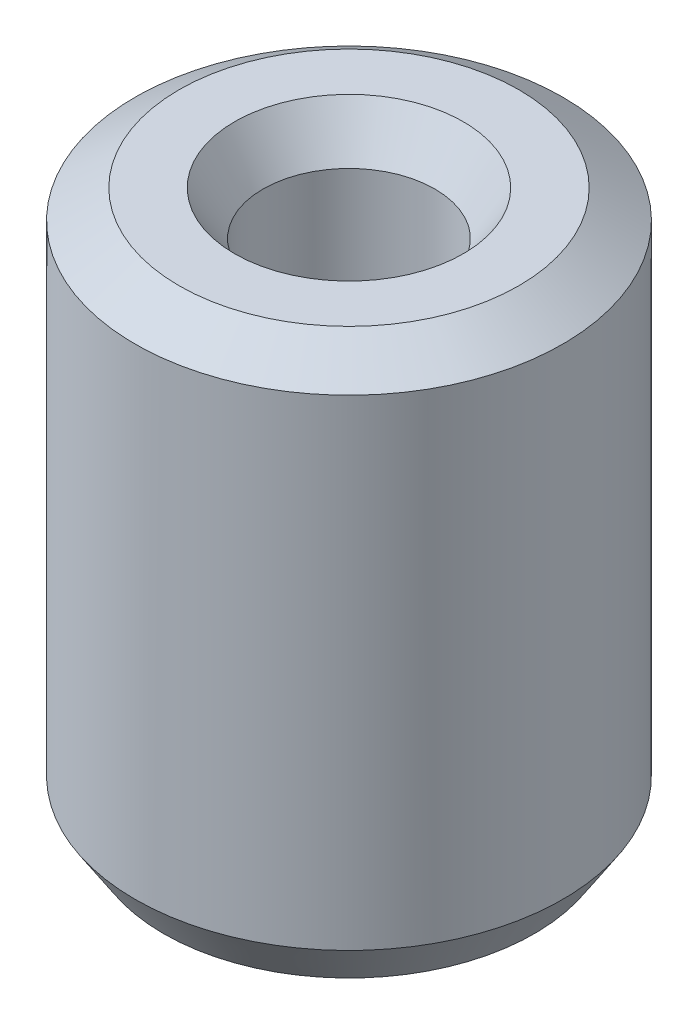
ISO-10303-21;
HEADER;
FILE_DESCRIPTION(('STEP AP214'),'2;1');
FILE_NAME('part.step','',(''),(''),'','','');
FILE_SCHEMA(('AUTOMOTIVE_DESIGN { 1 0 10303 214 1 1 1 1 }'));
ENDSEC;
DATA;
#1=APPLICATION_CONTEXT('core data for automotive mechanical design processes');
#2=APPLICATION_PROTOCOL_DEFINITION('international standard','automotive_design',2000,#1);
#3=PRODUCT_CONTEXT('',#1,'mechanical');
#4=PRODUCT('Part','Part','',(#3));
#5=PRODUCT_RELATED_PRODUCT_CATEGORY('part','',(#4));
#6=PRODUCT_DEFINITION_FORMATION('','',#4);
#7=PRODUCT_DEFINITION_CONTEXT('part definition',#1,'design');
#8=PRODUCT_DEFINITION('design','',#6,#7);
#9=PRODUCT_DEFINITION_SHAPE('','',#8);
#10=(LENGTH_UNIT() NAMED_UNIT(*) SI_UNIT(.MILLI.,.METRE.));
#11=(NAMED_UNIT(*) PLANE_ANGLE_UNIT() SI_UNIT($,.RADIAN.));
#12=(NAMED_UNIT(*) SI_UNIT($,.STERADIAN.) SOLID_ANGLE_UNIT());
#13=UNCERTAINTY_MEASURE_WITH_UNIT(LENGTH_MEASURE(1.E-05),#10,'distance_accuracy_value','');
#14=(GEOMETRIC_REPRESENTATION_CONTEXT(3) GLOBAL_UNCERTAINTY_ASSIGNED_CONTEXT((#13)) GLOBAL_UNIT_ASSIGNED_CONTEXT((#10,
#11,#12)) REPRESENTATION_CONTEXT('',''));
#15=CARTESIAN_POINT('',(0.,0.,0.));
#16=DIRECTION('',(0.,0.,1.));
#17=DIRECTION('',(1.,0.,0.));
#18=AXIS2_PLACEMENT_3D('',#15,#16,#17);
#19=CARTESIAN_POINT('',(0.,45.2807027686139,0.));
#20=DIRECTION('',(0.,-1.,0.));
#21=DIRECTION('',(0.,0.,-1.));
#22=AXIS2_PLACEMENT_3D('',#19,#20,#21);
#23=CYLINDRICAL_SURFACE('',#22,17.5);
#24=CARTESIAN_POINT('',(0.,3.60219334781976,0.));
#25=DIRECTION('',(0.,1.,0.));
#26=DIRECTION('',(0.,0.,1.));
#27=AXIS2_PLACEMENT_3D('',#24,#25,#26);
#28=CIRCLE('',#27,17.5);
#29=CARTESIAN_POINT('',(0.,3.60219334781976,-17.5));
#30=VERTEX_POINT('',#29);
#31=EDGE_CURVE('E10',#30,#30,#28,.T.);
#32=CARTESIAN_POINT('',(0.,42.949654786416,0.));
#33=DIRECTION('',(0.,1.,0.));
#34=DIRECTION('',(0.,0.,1.));
#35=AXIS2_PLACEMENT_3D('',#32,#33,#34);
#36=CIRCLE('',#35,17.5);
#37=CARTESIAN_POINT('',(0.,42.949654786416,-17.5));
#38=VERTEX_POINT('',#37);
#39=EDGE_CURVE('E50',#38,#38,#36,.F.);
#40=CARTESIAN_POINT('',(0.,3.60219334781976,-17.5));
#41=CARTESIAN_POINT('',(0.,4.01206273780514,-17.5));
#42=CARTESIAN_POINT('',(0.,4.42193212779052,-17.5));
#43=CARTESIAN_POINT('',(0.,5.24167090776127,-17.5));
#44=CARTESIAN_POINT('',(0.,5.65154029774665,-17.5));
#45=CARTESIAN_POINT('',(0.,6.4712790777174,-17.5));
#46=CARTESIAN_POINT('',(0.,6.88114846770278,-17.5));
#47=CARTESIAN_POINT('',(0.,7.70088724767353,-17.5));
#48=CARTESIAN_POINT('',(0.,8.11075663765891,-17.5));
#49=CARTESIAN_POINT('',(0.,8.93049541762966,-17.5));
#50=CARTESIAN_POINT('',(0.,9.34036480761504,-17.5));
#51=CARTESIAN_POINT('',(0.,10.1601035875858,-17.5));
#52=CARTESIAN_POINT('',(0.,10.5699729775712,-17.5));
#53=CARTESIAN_POINT('',(0.,11.3897117575419,-17.5));
#54=CARTESIAN_POINT('',(0.,11.7995811475273,-17.5));
#55=CARTESIAN_POINT('',(0.,12.6193199274981,-17.5));
#56=CARTESIAN_POINT('',(0.,13.0291893174834,-17.5));
#57=CARTESIAN_POINT('',(0.,13.8489280974542,-17.5));
#58=CARTESIAN_POINT('',(0.,14.2587974874396,-17.5));
#59=CARTESIAN_POINT('',(0.,15.0785362674103,-17.5));
#60=CARTESIAN_POINT('',(0.,15.4884056573957,-17.5));
#61=CARTESIAN_POINT('',(0.,16.3081444373664,-17.5));
#62=CARTESIAN_POINT('',(0.,16.7180138273518,-17.5));
#63=CARTESIAN_POINT('',(0.,17.5377526073226,-17.5));
#64=CARTESIAN_POINT('',(0.,17.947621997308,-17.5));
#65=CARTESIAN_POINT('',(0.,18.7673607772787,-17.5));
#66=CARTESIAN_POINT('',(0.,19.1772301672641,-17.5));
#67=CARTESIAN_POINT('',(0.,19.9969689472348,-17.5));
#68=CARTESIAN_POINT('',(0.,20.4068383372202,-17.5));
#69=CARTESIAN_POINT('',(0.,21.226577117191,-17.5));
#70=CARTESIAN_POINT('',(0.,21.6364465071763,-17.5));
#71=CARTESIAN_POINT('',(0.,22.4561852871471,-17.5));
#72=CARTESIAN_POINT('',(0.,22.8660546771325,-17.5));
#73=CARTESIAN_POINT('',(0.,23.6857934571032,-17.5));
#74=CARTESIAN_POINT('',(0.,24.0956628470886,-17.5));
#75=CARTESIAN_POINT('',(0.,24.9154016270594,-17.5));
#76=CARTESIAN_POINT('',(0.,25.3252710170447,-17.5));
#77=CARTESIAN_POINT('',(0.,26.1450097970155,-17.5));
#78=CARTESIAN_POINT('',(0.,26.5548791870009,-17.5));
#79=CARTESIAN_POINT('',(0.,27.3746179669716,-17.5));
#80=CARTESIAN_POINT('',(0.,27.784487356957,-17.5));
#81=CARTESIAN_POINT('',(0.,28.6042261369278,-17.5));
#82=CARTESIAN_POINT('',(0.,29.0140955269131,-17.5));
#83=CARTESIAN_POINT('',(0.,29.8338343068839,-17.5));
#84=CARTESIAN_POINT('',(0.,30.2437036968693,-17.5));
#85=CARTESIAN_POINT('',(0.,31.06344247684,-17.5));
#86=CARTESIAN_POINT('',(0.,31.4733118668254,-17.5));
#87=CARTESIAN_POINT('',(0.,32.2930506467962,-17.5));
#88=CARTESIAN_POINT('',(0.,32.7029200367815,-17.5));
#89=CARTESIAN_POINT('',(0.,33.5226588167523,-17.5));
#90=CARTESIAN_POINT('',(0.,33.9325282067377,-17.5));
#91=CARTESIAN_POINT('',(0.,34.7522669867084,-17.5));
#92=CARTESIAN_POINT('',(0.,35.1621363766938,-17.5));
#93=CARTESIAN_POINT('',(0.,35.9818751566645,-17.5));
#94=CARTESIAN_POINT('',(0.,36.3917445466499,-17.5));
#95=CARTESIAN_POINT('',(0.,37.2114833266207,-17.5));
#96=CARTESIAN_POINT('',(0.,37.6213527166061,-17.5));
#97=CARTESIAN_POINT('',(0.,38.4410914965768,-17.5));
#98=CARTESIAN_POINT('',(0.,38.8509608865622,-17.5));
#99=CARTESIAN_POINT('',(0.,39.6706996665329,-17.5));
#100=CARTESIAN_POINT('',(0.,40.0805690565183,-17.5));
#101=CARTESIAN_POINT('',(0.,40.9003078364891,-17.5));
#102=CARTESIAN_POINT('',(0.,41.3101772264744,-17.5));
#103=CARTESIAN_POINT('',(0.,42.1299160064452,-17.5));
#104=CARTESIAN_POINT('',(0.,42.5397853964306,-17.5));
#105=CARTESIAN_POINT('',(0.,42.949654786416,-17.5));
#106=B_SPLINE_CURVE_WITH_KNOTS('',3,(#40,#41,#42,#43,#44,#45,#46,#47,#48,#49,#50,#51,#52,#53,
#54,#55,#56,#57,#58,#59,#60,#61,#62,#63,#64,#65,#66,#67,#68,#69,#70,#71,#72,#73,#74,#75,#76,#77,
#78,#79,#80,#81,#82,#83,#84,#85,#86,#87,#88,#89,#90,#91,#92,#93,#94,#95,#96,#97,#98,#99,#100,
#101,#102,#103,#104,#105),.UNSPECIFIED.,.F.,.F.,(4,2,2,2,2,2,2,2,2,2,2,2,2,2,2,2,2,2,2,2,2,2,2,
2,2,2,2,2,2,2,2,2,4),(0.,1.22960816995613,2.45921633991227,3.68882450986839,4.91843267982452,
6.14804084978066,7.37764901973679,8.60725718969292,9.83686535964905,11.0664735296052,
12.2960816995613,13.5256898695174,14.7552980394736,15.9849062094297,17.2145143793858,
18.444122549342,19.6737307192981,20.9033388892542,22.1329470592104,23.3625552291665,
24.5921633991226,25.8217715690788,27.0513797390349,28.280987908991,29.5105960789471,
30.7402042489033,31.9698124188594,33.1994205888155,34.4290287587717,35.6586369287278,
36.8882450986839,38.1178532686401,39.3474614385962),.UNSPECIFIED.);
#107=EDGE_CURVE('BSEAM39',#30,#38,#106,.T.);
#108=ORIENTED_EDGE('',*,*,#31,.T.);
#109=ORIENTED_EDGE('',*,*,#39,.T.);
#110=ORIENTED_EDGE('',*,*,#107,.T.);
#111=ORIENTED_EDGE('',*,*,#107,.F.);
#112=EDGE_LOOP('',(#108,#110,#109,#111));
#113=FACE_BOUND('',#112,.T.);
#114=ADVANCED_FACE('F39',(#113),#23,.T.);
#115=CARTESIAN_POINT('',(0.,45.2807027686139,0.));
#116=DIRECTION('',(0.,1.,0.));
#117=DIRECTION('',(0.,0.,1.));
#118=AXIS2_PLACEMENT_3D('',#115,#116,#117);
#119=PLANE('',#118);
#120=CARTESIAN_POINT('',(0.,45.2807027686139,0.));
#121=DIRECTION('',(0.,1.,0.));
#122=DIRECTION('',(0.,0.,1.));
#123=AXIS2_PLACEMENT_3D('',#120,#121,#122);
#124=CIRCLE('',#123,9.35995649386946);
#125=CARTESIAN_POINT('',(0.,45.2807027686139,9.35995649386946));
#126=VERTEX_POINT('',#125);
#127=EDGE_CURVE('E58',#126,#126,#124,.F.);
#128=ORIENTED_EDGE('',*,*,#127,.T.);
#129=EDGE_LOOP('',(#128));
#130=FACE_BOUND('',#129,.T.);
#131=CARTESIAN_POINT('',(0.,45.2807027686139,0.));
#132=DIRECTION('',(0.,1.,0.));
#133=DIRECTION('',(0.,0.,1.));
#134=AXIS2_PLACEMENT_3D('',#131,#132,#133);
#135=CIRCLE('',#134,13.8978066521804);
#136=CARTESIAN_POINT('',(0.,45.2807027686139,13.8978066521804));
#137=VERTEX_POINT('',#136);
#138=EDGE_CURVE('E61',#137,#137,#135,.T.);
#139=ORIENTED_EDGE('',*,*,#138,.T.);
#140=EDGE_LOOP('',(#139));
#141=FACE_BOUND('',#140,.T.);
#142=ADVANCED_FACE('F88',(#130,#141),#119,.T.);
#143=CARTESIAN_POINT('',(0.,0.,0.));
#144=DIRECTION('',(0.,1.,0.));
#145=DIRECTION('',(0.,0.,1.));
#146=AXIS2_PLACEMENT_3D('',#143,#144,#145);
#147=PLANE('',#146);
#148=CARTESIAN_POINT('',(0.,0.,0.));
#149=DIRECTION('',(0.,1.,0.));
#150=DIRECTION('',(0.,0.,1.));
#151=AXIS2_PLACEMENT_3D('',#148,#149,#150);
#152=CIRCLE('',#151,10.6311018594911);
#153=CARTESIAN_POINT('',(0.,0.,10.6311018594911));
#154=VERTEX_POINT('',#153);
#155=EDGE_CURVE('E51',#154,#154,#152,.T.);
#156=ORIENTED_EDGE('',*,*,#155,.T.);
#157=EDGE_LOOP('',(#156));
#158=FACE_BOUND('',#157,.T.);
#159=CARTESIAN_POINT('',(0.,0.,0.));
#160=DIRECTION('',(0.,1.,0.));
#161=DIRECTION('',(0.,0.,1.));
#162=AXIS2_PLACEMENT_3D('',#159,#160,#161);
#163=CIRCLE('',#162,15.168952017802);
#164=CARTESIAN_POINT('',(0.,0.,15.168952017802));
#165=VERTEX_POINT('',#164);
#166=EDGE_CURVE('E54',#165,#165,#163,.F.);
#167=ORIENTED_EDGE('',*,*,#166,.T.);
#168=EDGE_LOOP('',(#167));
#169=FACE_BOUND('',#168,.T.);
#170=ADVANCED_FACE('F83',(#158,#169),#147,.F.);
#171=CARTESIAN_POINT('',(0.,45.2807027686139,0.));
#172=DIRECTION('',(0.,-1.,0.));
#173=DIRECTION('',(0.,0.,-1.));
#174=AXIS2_PLACEMENT_3D('',#171,#172,#173);
#175=CYLINDRICAL_SURFACE('',#174,7.0289085116715);
#176=CARTESIAN_POINT('',(0.,41.6785094207942,0.));
#177=DIRECTION('',(0.,1.,0.));
#178=DIRECTION('',(0.,0.,1.));
#179=AXIS2_PLACEMENT_3D('',#176,#177,#178);
#180=CIRCLE('',#179,7.0289085116715);
#181=CARTESIAN_POINT('',(0.,41.6785094207942,-7.0289085116715));
#182=VERTEX_POINT('',#181);
#183=EDGE_CURVE('E67',#182,#182,#180,.T.);
#184=CARTESIAN_POINT('',(0.,2.33104798219794,0.));
#185=DIRECTION('',(0.,1.,0.));
#186=DIRECTION('',(0.,0.,1.));
#187=AXIS2_PLACEMENT_3D('',#184,#185,#186);
#188=CIRCLE('',#187,7.0289085116715);
#189=CARTESIAN_POINT('',(0.,2.33104798219794,-7.0289085116715));
#190=VERTEX_POINT('',#189);
#191=EDGE_CURVE('E69',#190,#190,#188,.F.);
#192=CARTESIAN_POINT('',(0.,41.6785094207942,-7.0289085116715));
#193=CARTESIAN_POINT('',(0.,41.2686400308088,-7.0289085116715));
#194=CARTESIAN_POINT('',(0.,40.8587706408234,-7.0289085116715));
#195=CARTESIAN_POINT('',(0.,40.0390318608527,-7.0289085116715));
#196=CARTESIAN_POINT('',(0.,39.6291624708673,-7.0289085116715));
#197=CARTESIAN_POINT('',(0.,38.8094236908965,-7.0289085116715));
#198=CARTESIAN_POINT('',(0.,38.3995543009112,-7.0289085116715));
#199=CARTESIAN_POINT('',(0.,37.5798155209404,-7.0289085116715));
#200=CARTESIAN_POINT('',(0.,37.169946130955,-7.0289085116715));
#201=CARTESIAN_POINT('',(0.,36.3502073509843,-7.0289085116715));
#202=CARTESIAN_POINT('',(0.,35.9403379609989,-7.0289085116715));
#203=CARTESIAN_POINT('',(0.,35.1205991810281,-7.0289085116715));
#204=CARTESIAN_POINT('',(0.,34.7107297910428,-7.0289085116715));
#205=CARTESIAN_POINT('',(0.,33.890991011072,-7.0289085116715));
#206=CARTESIAN_POINT('',(0.,33.4811216210866,-7.0289085116715));
#207=CARTESIAN_POINT('',(0.,32.6613828411159,-7.0289085116715));
#208=CARTESIAN_POINT('',(0.,32.2515134511305,-7.0289085116715));
#209=CARTESIAN_POINT('',(0.,31.4317746711597,-7.0289085116715));
#210=CARTESIAN_POINT('',(0.,31.0219052811744,-7.0289085116715));
#211=CARTESIAN_POINT('',(0.,30.2021665012036,-7.0289085116715));
#212=CARTESIAN_POINT('',(0.,29.7922971112182,-7.0289085116715));
#213=CARTESIAN_POINT('',(0.,28.9725583312475,-7.0289085116715));
#214=CARTESIAN_POINT('',(0.,28.5626889412621,-7.0289085116715));
#215=CARTESIAN_POINT('',(0.,27.7429501612914,-7.0289085116715));
#216=CARTESIAN_POINT('',(0.,27.333080771306,-7.0289085116715));
#217=CARTESIAN_POINT('',(0.,26.5133419913352,-7.0289085116715));
#218=CARTESIAN_POINT('',(0.,26.1034726013498,-7.0289085116715));
#219=CARTESIAN_POINT('',(0.,25.2837338213791,-7.0289085116715));
#220=CARTESIAN_POINT('',(0.,24.8738644313937,-7.0289085116715));
#221=CARTESIAN_POINT('',(0.,24.054125651423,-7.0289085116715));
#222=CARTESIAN_POINT('',(0.,23.6442562614376,-7.0289085116715));
#223=CARTESIAN_POINT('',(0.,22.8245174814668,-7.0289085116715));
#224=CARTESIAN_POINT('',(0.,22.4146480914814,-7.0289085116715));
#225=CARTESIAN_POINT('',(0.,21.5949093115107,-7.0289085116715));
#226=CARTESIAN_POINT('',(0.,21.1850399215253,-7.0289085116715));
#227=CARTESIAN_POINT('',(0.,20.3653011415546,-7.0289085116715));
#228=CARTESIAN_POINT('',(0.,19.9554317515692,-7.0289085116715));
#229=CARTESIAN_POINT('',(0.,19.1356929715984,-7.0289085116715));
#230=CARTESIAN_POINT('',(0.,18.725823581613,-7.0289085116715));
#231=CARTESIAN_POINT('',(0.,17.9060848016423,-7.0289085116715));
#232=CARTESIAN_POINT('',(0.,17.4962154116569,-7.0289085116715));
#233=CARTESIAN_POINT('',(0.,16.6764766316862,-7.0289085116715));
#234=CARTESIAN_POINT('',(0.,16.2666072417008,-7.0289085116715));
#235=CARTESIAN_POINT('',(0.,15.44686846173,-7.0289085116715));
#236=CARTESIAN_POINT('',(0.,15.0369990717446,-7.0289085116715));
#237=CARTESIAN_POINT('',(0.,14.2172602917739,-7.0289085116715));
#238=CARTESIAN_POINT('',(0.,13.8073909017885,-7.0289085116715));
#239=CARTESIAN_POINT('',(0.,12.9876521218178,-7.0289085116715));
#240=CARTESIAN_POINT('',(0.,12.5777827318324,-7.0289085116715));
#241=CARTESIAN_POINT('',(0.,11.7580439518616,-7.0289085116715));
#242=CARTESIAN_POINT('',(0.,11.3481745618762,-7.0289085116715));
#243=CARTESIAN_POINT('',(0.,10.5284357819055,-7.0289085116715));
#244=CARTESIAN_POINT('',(0.,10.1185663919201,-7.0289085116715));
#245=CARTESIAN_POINT('',(0.,9.29882761194935,-7.0289085116715));
#246=CARTESIAN_POINT('',(0.,8.88895822196398,-7.0289085116715));
#247=CARTESIAN_POINT('',(0.,8.06921944199322,-7.0289085116715));
#248=CARTESIAN_POINT('',(0.,7.65935005200785,-7.0289085116715));
#249=CARTESIAN_POINT('',(0.,6.83961127203709,-7.0289085116715));
#250=CARTESIAN_POINT('',(0.,6.42974188205171,-7.0289085116715));
#251=CARTESIAN_POINT('',(0.,5.61000310208096,-7.0289085116715));
#252=CARTESIAN_POINT('',(0.,5.20013371209558,-7.0289085116715));
#253=CARTESIAN_POINT('',(0.,4.38039493212482,-7.0289085116715));
#254=CARTESIAN_POINT('',(0.,3.97052554213945,-7.0289085116715));
#255=CARTESIAN_POINT('',(0.,3.15078676216869,-7.0289085116715));
#256=CARTESIAN_POINT('',(0.,2.74091737218331,-7.0289085116715));
#257=CARTESIAN_POINT('',(0.,2.33104798219794,-7.0289085116715));
#258=B_SPLINE_CURVE_WITH_KNOTS('',3,(#192,#193,#194,#195,#196,#197,#198,#199,#200,#201,#202,
#203,#204,#205,#206,#207,#208,#209,#210,#211,#212,#213,#214,#215,#216,#217,#218,#219,#220,#221,
#222,#223,#224,#225,#226,#227,#228,#229,#230,#231,#232,#233,#234,#235,#236,#237,#238,#239,#240,
#241,#242,#243,#244,#245,#246,#247,#248,#249,#250,#251,#252,#253,#254,#255,#256,#257),
.UNSPECIFIED.,.F.,.F.,(4,2,2,2,2,2,2,2,2,2,2,2,2,2,2,2,2,2,2,2,2,2,2,2,2,2,2,2,2,2,2,2,4),(0.,
1.22960816995613,2.45921633991227,3.6888245098684,4.91843267982453,6.14804084978066,
7.3776490197368,8.60725718969293,9.83686535964906,11.0664735296052,12.2960816995613,
13.5256898695175,14.7552980394736,15.9849062094297,17.2145143793859,18.444122549342,
19.6737307192981,20.9033388892543,22.1329470592104,23.3625552291665,24.5921633991227,
25.8217715690788,27.0513797390349,28.2809879089911,29.5105960789472,30.7402042489033,
31.9698124188595,33.1994205888156,34.4290287587717,35.6586369287279,36.888245098684,
38.1178532686401,39.3474614385962),.UNSPECIFIED.);
#259=EDGE_CURVE('BSEAM71',#182,#190,#258,.T.);
#260=ORIENTED_EDGE('',*,*,#183,.T.);
#261=ORIENTED_EDGE('',*,*,#191,.T.);
#262=ORIENTED_EDGE('',*,*,#259,.T.);
#263=ORIENTED_EDGE('',*,*,#259,.F.);
#264=EDGE_LOOP('',(#260,#262,#261,#263));
#265=FACE_BOUND('',#264,.T.);
#266=ADVANCED_FACE('F71',(#265),#175,.F.);
#267=CARTESIAN_POINT('',(0.,41.6785094207942,0.));
#268=DIRECTION('',(0.,1.,0.));
#269=DIRECTION('',(0.,0.,1.));
#270=AXIS2_PLACEMENT_3D('',#267,#268,#269);
#271=CONICAL_SURFACE('',#270,7.0289085116715,0.574347290138716);
#272=ORIENTED_EDGE('',*,*,#127,.F.);
#273=EDGE_LOOP('',(#272));
#274=FACE_BOUND('',#273,.T.);
#275=ORIENTED_EDGE('',*,*,#183,.F.);
#276=EDGE_LOOP('',(#275));
#277=FACE_BOUND('',#276,.T.);
#278=ADVANCED_FACE('F77',(#274,#277),#271,.F.);
#279=CARTESIAN_POINT('',(0.,0.,0.));
#280=DIRECTION('',(0.,-1.,0.));
#281=DIRECTION('',(0.,0.,-1.));
#282=AXIS2_PLACEMENT_3D('',#279,#280,#281);
#283=CONICAL_SURFACE('',#282,10.6311018594911,0.996449036656179);
#284=ORIENTED_EDGE('',*,*,#191,.F.);
#285=EDGE_LOOP('',(#284));
#286=FACE_BOUND('',#285,.T.);
#287=ORIENTED_EDGE('',*,*,#155,.F.);
#288=EDGE_LOOP('',(#287));
#289=FACE_BOUND('',#288,.T.);
#290=ADVANCED_FACE('F73',(#286,#289),#283,.F.);
#291=CARTESIAN_POINT('',(0.,3.60219334781976,0.));
#292=DIRECTION('',(0.,1.,0.));
#293=DIRECTION('',(0.,0.,1.));
#294=AXIS2_PLACEMENT_3D('',#291,#292,#293);
#295=CONICAL_SURFACE('',#294,17.5,0.574347290138716);
#296=ORIENTED_EDGE('',*,*,#166,.F.);
#297=EDGE_LOOP('',(#296));
#298=FACE_BOUND('',#297,.T.);
#299=ORIENTED_EDGE('',*,*,#31,.F.);
#300=EDGE_LOOP('',(#299));
#301=FACE_BOUND('',#300,.T.);
#302=ADVANCED_FACE('F76',(#298,#301),#295,.T.);
#303=CARTESIAN_POINT('',(0.,45.2807027686139,0.));
#304=DIRECTION('',(0.,-1.,0.));
#305=DIRECTION('',(0.,0.,-1.));
#306=AXIS2_PLACEMENT_3D('',#303,#304,#305);
#307=CONICAL_SURFACE('',#306,13.8978066521804,0.99644903665618);
#308=ORIENTED_EDGE('',*,*,#39,.F.);
#309=EDGE_LOOP('',(#308));
#310=FACE_BOUND('',#309,.T.);
#311=ORIENTED_EDGE('',*,*,#138,.F.);
#312=EDGE_LOOP('',(#311));
#313=FACE_BOUND('',#312,.T.);
#314=ADVANCED_FACE('F45',(#310,#313),#307,.T.);
#315=CLOSED_SHELL('',(#114,#142,#170,#266,#278,#290,#302,#314));
#316=MANIFOLD_SOLID_BREP('B2',#315);
#317=ADVANCED_BREP_SHAPE_REPRESENTATION('',(#18,#316),#14);
#318=SHAPE_DEFINITION_REPRESENTATION(#9,#317);
ENDSEC;
END-ISO-10303-21;
